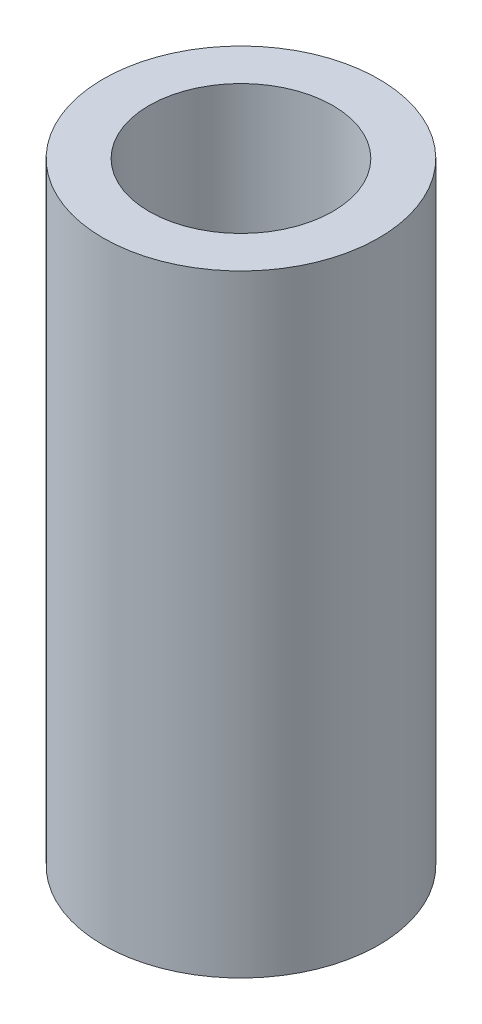
ISO-10303-21;
HEADER;
FILE_DESCRIPTION(('STEP AP214'),'2;1');
FILE_NAME('part.step','',(''),(''),'','','');
FILE_SCHEMA(('AUTOMOTIVE_DESIGN { 1 0 10303 214 1 1 1 1 }'));
ENDSEC;
DATA;
#1=APPLICATION_CONTEXT('core data for automotive mechanical design processes');
#2=APPLICATION_PROTOCOL_DEFINITION('international standard','automotive_design',2000,#1);
#3=PRODUCT_CONTEXT('',#1,'mechanical');
#4=PRODUCT('Part','Part','',(#3));
#5=PRODUCT_RELATED_PRODUCT_CATEGORY('part','',(#4));
#6=PRODUCT_DEFINITION_FORMATION('','',#4);
#7=PRODUCT_DEFINITION_CONTEXT('part definition',#1,'design');
#8=PRODUCT_DEFINITION('design','',#6,#7);
#9=PRODUCT_DEFINITION_SHAPE('','',#8);
#10=(LENGTH_UNIT() NAMED_UNIT(*) SI_UNIT(.MILLI.,.METRE.));
#11=(NAMED_UNIT(*) PLANE_ANGLE_UNIT() SI_UNIT($,.RADIAN.));
#12=(NAMED_UNIT(*) SI_UNIT($,.STERADIAN.) SOLID_ANGLE_UNIT());
#13=UNCERTAINTY_MEASURE_WITH_UNIT(LENGTH_MEASURE(1.E-05),#10,'distance_accuracy_value','');
#14=(GEOMETRIC_REPRESENTATION_CONTEXT(3) GLOBAL_UNCERTAINTY_ASSIGNED_CONTEXT((#13)) GLOBAL_UNIT_ASSIGNED_CONTEXT((#10,
#11,#12)) REPRESENTATION_CONTEXT('',''));
#15=CARTESIAN_POINT('',(0.,0.,0.));
#16=DIRECTION('',(0.,0.,1.));
#17=DIRECTION('',(1.,0.,0.));
#18=AXIS2_PLACEMENT_3D('',#15,#16,#17);
#19=CARTESIAN_POINT('',(0.,20.,0.));
#20=DIRECTION('',(0.,-1.,0.));
#21=DIRECTION('',(0.,0.,-1.));
#22=AXIS2_PLACEMENT_3D('',#19,#20,#21);
#23=CYLINDRICAL_SURFACE('',#22,4.5);
#24=CARTESIAN_POINT('',(0.,20.,0.));
#25=DIRECTION('',(0.,1.,0.));
#26=DIRECTION('',(0.,0.,1.));
#27=AXIS2_PLACEMENT_3D('',#24,#25,#26);
#28=CIRCLE('',#27,4.5);
#29=CARTESIAN_POINT('',(0.,20.,4.5));
#30=VERTEX_POINT('',#29);
#31=EDGE_CURVE('E10',#30,#30,#28,.T.);
#32=ORIENTED_EDGE('',*,*,#31,.F.);
#33=EDGE_LOOP('',(#32));
#34=FACE_BOUND('',#33,.T.);
#35=CARTESIAN_POINT('',(0.,0.,0.));
#36=DIRECTION('',(0.,1.,0.));
#37=DIRECTION('',(0.,0.,1.));
#38=AXIS2_PLACEMENT_3D('',#35,#36,#37);
#39=CIRCLE('',#38,4.5);
#40=CARTESIAN_POINT('',(0.,0.,4.5));
#41=VERTEX_POINT('',#40);
#42=EDGE_CURVE('E42',#41,#41,#39,.T.);
#43=ORIENTED_EDGE('',*,*,#42,.T.);
#44=EDGE_LOOP('',(#43));
#45=FACE_BOUND('',#44,.T.);
#46=ADVANCED_FACE('F39',(#34,#45),#23,.T.);
#47=CARTESIAN_POINT('',(0.,20.,0.));
#48=DIRECTION('',(0.,1.,0.));
#49=DIRECTION('',(0.,0.,1.));
#50=AXIS2_PLACEMENT_3D('',#47,#48,#49);
#51=PLANE('',#50);
#52=CARTESIAN_POINT('',(0.,20.,0.));
#53=DIRECTION('',(0.,1.,0.));
#54=DIRECTION('',(0.,0.,1.));
#55=AXIS2_PLACEMENT_3D('',#52,#53,#54);
#56=CIRCLE('',#55,3.);
#57=CARTESIAN_POINT('',(0.,20.,3.));
#58=VERTEX_POINT('',#57);
#59=EDGE_CURVE('E53',#58,#58,#56,.T.);
#60=ORIENTED_EDGE('',*,*,#59,.F.);
#61=EDGE_LOOP('',(#60));
#62=FACE_BOUND('',#61,.T.);
#63=ORIENTED_EDGE('',*,*,#31,.T.);
#64=EDGE_LOOP('',(#63));
#65=FACE_BOUND('',#64,.T.);
#66=ADVANCED_FACE('F82',(#62,#65),#51,.T.);
#67=CARTESIAN_POINT('',(0.,0.,0.));
#68=DIRECTION('',(0.,1.,0.));
#69=DIRECTION('',(0.,0.,1.));
#70=AXIS2_PLACEMENT_3D('',#67,#68,#69);
#71=PLANE('',#70);
#72=CARTESIAN_POINT('',(0.,0.,0.));
#73=DIRECTION('',(0.,-1.,0.));
#74=DIRECTION('',(0.,0.,-1.));
#75=AXIS2_PLACEMENT_3D('',#72,#73,#74);
#76=CIRCLE('',#75,2.5);
#77=CARTESIAN_POINT('',(0.,0.,-2.5));
#78=VERTEX_POINT('',#77);
#79=EDGE_CURVE('E61',#78,#78,#76,.T.);
#80=ORIENTED_EDGE('',*,*,#79,.F.);
#81=EDGE_LOOP('',(#80));
#82=FACE_BOUND('',#81,.T.);
#83=ORIENTED_EDGE('',*,*,#42,.F.);
#84=EDGE_LOOP('',(#83));
#85=FACE_BOUND('',#84,.T.);
#86=ADVANCED_FACE('F78',(#82,#85),#71,.F.);
#87=CARTESIAN_POINT('',(0.,10.,0.));
#88=DIRECTION('',(0.,1.,0.));
#89=DIRECTION('',(0.,0.,1.));
#90=AXIS2_PLACEMENT_3D('',#87,#88,#89);
#91=CYLINDRICAL_SURFACE('',#90,3.);
#92=CARTESIAN_POINT('',(0.,10.,0.));
#93=DIRECTION('',(0.,1.,0.));
#94=DIRECTION('',(0.,0.,1.));
#95=AXIS2_PLACEMENT_3D('',#92,#93,#94);
#96=CIRCLE('',#95,3.);
#97=CARTESIAN_POINT('',(0.,10.,3.));
#98=VERTEX_POINT('',#97);
#99=EDGE_CURVE('E51',#98,#98,#96,.T.);
#100=ORIENTED_EDGE('',*,*,#99,.F.);
#101=EDGE_LOOP('',(#100));
#102=FACE_BOUND('',#101,.T.);
#103=ORIENTED_EDGE('',*,*,#59,.T.);
#104=EDGE_LOOP('',(#103));
#105=FACE_BOUND('',#104,.T.);
#106=ADVANCED_FACE('F81',(#102,#105),#91,.F.);
#107=CARTESIAN_POINT('',(0.,10.,0.));
#108=DIRECTION('',(0.,1.,0.));
#109=DIRECTION('',(0.,0.,1.));
#110=AXIS2_PLACEMENT_3D('',#107,#108,#109);
#111=PLANE('',#110);
#112=CARTESIAN_POINT('',(0.,10.,0.));
#113=DIRECTION('',(0.,-1.,0.));
#114=DIRECTION('',(0.,0.,-1.));
#115=AXIS2_PLACEMENT_3D('',#112,#113,#114);
#116=CIRCLE('',#115,2.5);
#117=CARTESIAN_POINT('',(0.,10.,-2.5));
#118=VERTEX_POINT('',#117);
#119=EDGE_CURVE('E57',#118,#118,#116,.T.);
#120=ORIENTED_EDGE('',*,*,#119,.T.);
#121=EDGE_LOOP('',(#120));
#122=FACE_BOUND('',#121,.T.);
#123=ORIENTED_EDGE('',*,*,#99,.T.);
#124=EDGE_LOOP('',(#123));
#125=FACE_BOUND('',#124,.T.);
#126=ADVANCED_FACE('F69',(#122,#125),#111,.T.);
#127=CARTESIAN_POINT('',(0.,10.,0.));
#128=DIRECTION('',(0.,-1.,0.));
#129=DIRECTION('',(0.,0.,-1.));
#130=AXIS2_PLACEMENT_3D('',#127,#128,#129);
#131=CYLINDRICAL_SURFACE('',#130,2.5);
#132=ORIENTED_EDGE('',*,*,#119,.F.);
#133=EDGE_LOOP('',(#132));
#134=FACE_BOUND('',#133,.T.);
#135=ORIENTED_EDGE('',*,*,#79,.T.);
#136=EDGE_LOOP('',(#135));
#137=FACE_BOUND('',#136,.T.);
#138=ADVANCED_FACE('F72',(#134,#137),#131,.F.);
#139=CLOSED_SHELL('',(#46,#66,#86,#106,#126,#138));
#140=MANIFOLD_SOLID_BREP('B2',#139);
#141=ADVANCED_BREP_SHAPE_REPRESENTATION('',(#18,#140),#14);
#142=SHAPE_DEFINITION_REPRESENTATION(#9,#141);
ENDSEC;
END-ISO-10303-21;
